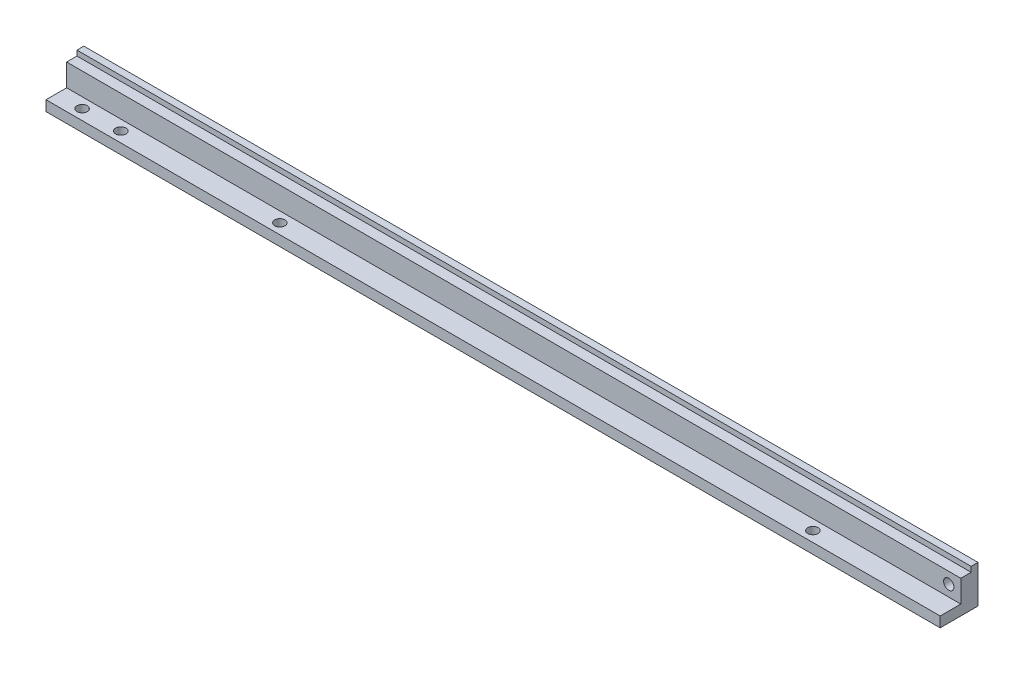
ISO-10303-21;
HEADER;
FILE_DESCRIPTION(('STEP AP214'),'2;1');
FILE_NAME('part.step','',(''),(''),'','','');
FILE_SCHEMA(('AUTOMOTIVE_DESIGN { 1 0 10303 214 1 1 1 1 }'));
ENDSEC;
DATA;
#1=APPLICATION_CONTEXT('core data for automotive mechanical design processes');
#2=APPLICATION_PROTOCOL_DEFINITION('international standard','automotive_design',2000,#1);
#3=PRODUCT_CONTEXT('',#1,'mechanical');
#4=PRODUCT('Part','Part','',(#3));
#5=PRODUCT_RELATED_PRODUCT_CATEGORY('part','',(#4));
#6=PRODUCT_DEFINITION_FORMATION('','',#4);
#7=PRODUCT_DEFINITION_CONTEXT('part definition',#1,'design');
#8=PRODUCT_DEFINITION('design','',#6,#7);
#9=PRODUCT_DEFINITION_SHAPE('','',#8);
#10=(LENGTH_UNIT() NAMED_UNIT(*) SI_UNIT(.MILLI.,.METRE.));
#11=(NAMED_UNIT(*) PLANE_ANGLE_UNIT() SI_UNIT($,.RADIAN.));
#12=(NAMED_UNIT(*) SI_UNIT($,.STERADIAN.) SOLID_ANGLE_UNIT());
#13=UNCERTAINTY_MEASURE_WITH_UNIT(LENGTH_MEASURE(1.E-05),#10,'distance_accuracy_value','');
#14=(GEOMETRIC_REPRESENTATION_CONTEXT(3) GLOBAL_UNCERTAINTY_ASSIGNED_CONTEXT((#13)) GLOBAL_UNIT_ASSIGNED_CONTEXT((#10,
#11,#12)) REPRESENTATION_CONTEXT('',''));
#15=CARTESIAN_POINT('',(0.,0.,0.));
#16=DIRECTION('',(0.,0.,1.));
#17=DIRECTION('',(1.,0.,0.));
#18=AXIS2_PLACEMENT_3D('',#15,#16,#17);
#19=CARTESIAN_POINT('',(260.,11.,0.));
#20=DIRECTION('',(0.,0.,1.));
#21=DIRECTION('',(0.,-1.,0.));
#22=AXIS2_PLACEMENT_3D('',#19,#20,#21);
#23=PLANE('',#22);
#24=CARTESIAN_POINT('',(256.5,6.25,0.));
#25=DIRECTION('',(0.,0.,1.));
#26=DIRECTION('',(1.,0.,0.));
#27=AXIS2_PLACEMENT_3D('',#24,#25,#26);
#28=CIRCLE('',#27,1.50000000000002);
#29=CARTESIAN_POINT('',(258.,6.25,0.));
#30=VERTEX_POINT('',#29);
#31=EDGE_CURVE('E134',#30,#30,#28,.T.);
#32=ORIENTED_EDGE('',*,*,#31,.T.);
#33=EDGE_LOOP('',(#32));
#34=FACE_BOUND('',#33,.T.);
#35=DIRECTION('',(0.,1.,0.));
#36=VECTOR('',#35,1.);
#37=CARTESIAN_POINT('',(0.,11.,0.));
#38=LINE('',#37,#36);
#39=CARTESIAN_POINT('',(0.,0.,0.));
#40=VERTEX_POINT('',#39);
#41=CARTESIAN_POINT('',(0.,11.,0.));
#42=VERTEX_POINT('',#41);
#43=EDGE_CURVE('E130',#40,#42,#38,.T.);
#44=ORIENTED_EDGE('',*,*,#43,.T.);
#45=DIRECTION('',(-1.,0.,0.));
#46=VECTOR('',#45,1.);
#47=CARTESIAN_POINT('',(260.,11.,0.));
#48=LINE('',#47,#46);
#49=CARTESIAN_POINT('',(260.,11.,0.));
#50=VERTEX_POINT('',#49);
#51=EDGE_CURVE('E11',#50,#42,#48,.T.);
#52=ORIENTED_EDGE('',*,*,#51,.F.);
#53=DIRECTION('',(0.,1.,0.));
#54=VECTOR('',#53,1.);
#55=CARTESIAN_POINT('',(260.,11.,0.));
#56=LINE('',#55,#54);
#57=CARTESIAN_POINT('',(260.,0.,0.));
#58=VERTEX_POINT('',#57);
#59=EDGE_CURVE('E145',#58,#50,#56,.T.);
#60=ORIENTED_EDGE('',*,*,#59,.F.);
#61=DIRECTION('',(-1.,0.,0.));
#62=VECTOR('',#61,1.);
#63=CARTESIAN_POINT('',(260.,0.,0.));
#64=LINE('',#63,#62);
#65=EDGE_CURVE('E126',#58,#40,#64,.T.);
#66=ORIENTED_EDGE('',*,*,#65,.T.);
#67=EDGE_LOOP('',(#44,#52,#60,#66));
#68=FACE_BOUND('',#67,.T.);
#69=ADVANCED_FACE('F34',(#34,#68),#23,.F.);
#70=CARTESIAN_POINT('',(260.,11.,2.));
#71=DIRECTION('',(0.,-1.,0.));
#72=DIRECTION('',(0.,0.,-1.));
#73=AXIS2_PLACEMENT_3D('',#70,#71,#72);
#74=PLANE('',#73);
#75=DIRECTION('',(0.,0.,1.));
#76=VECTOR('',#75,1.);
#77=CARTESIAN_POINT('',(0.,11.,2.));
#78=LINE('',#77,#76);
#79=CARTESIAN_POINT('',(0.,11.,2.));
#80=VERTEX_POINT('',#79);
#81=EDGE_CURVE('E133',#42,#80,#78,.T.);
#82=ORIENTED_EDGE('',*,*,#81,.T.);
#83=DIRECTION('',(-1.,0.,0.));
#84=VECTOR('',#83,1.);
#85=CARTESIAN_POINT('',(260.,11.,2.));
#86=LINE('',#85,#84);
#87=CARTESIAN_POINT('',(260.,11.,2.));
#88=VERTEX_POINT('',#87);
#89=EDGE_CURVE('E42',#88,#80,#86,.T.);
#90=ORIENTED_EDGE('',*,*,#89,.F.);
#91=DIRECTION('',(0.,0.,1.));
#92=VECTOR('',#91,1.);
#93=CARTESIAN_POINT('',(260.,11.,2.));
#94=LINE('',#93,#92);
#95=EDGE_CURVE('E93',#50,#88,#94,.T.);
#96=ORIENTED_EDGE('',*,*,#95,.F.);
#97=ORIENTED_EDGE('',*,*,#51,.T.);
#98=EDGE_LOOP('',(#82,#90,#96,#97));
#99=FACE_BOUND('',#98,.T.);
#100=ADVANCED_FACE('F243',(#99),#74,.F.);
#101=CARTESIAN_POINT('',(260.,9.5,2.));
#102=DIRECTION('',(0.,0.,-1.));
#103=DIRECTION('',(-1.,0.,0.));
#104=AXIS2_PLACEMENT_3D('',#101,#102,#103);
#105=PLANE('',#104);
#106=DIRECTION('',(0.,-1.,0.));
#107=VECTOR('',#106,1.);
#108=CARTESIAN_POINT('',(0.,9.5,2.));
#109=LINE('',#108,#107);
#110=CARTESIAN_POINT('',(0.,9.5,2.));
#111=VERTEX_POINT('',#110);
#112=EDGE_CURVE('E136',#80,#111,#109,.T.);
#113=ORIENTED_EDGE('',*,*,#112,.T.);
#114=DIRECTION('',(-1.,0.,0.));
#115=VECTOR('',#114,1.);
#116=CARTESIAN_POINT('',(260.,9.5,2.));
#117=LINE('',#116,#115);
#118=CARTESIAN_POINT('',(260.,9.5,2.));
#119=VERTEX_POINT('',#118);
#120=EDGE_CURVE('E152',#119,#111,#117,.T.);
#121=ORIENTED_EDGE('',*,*,#120,.F.);
#122=DIRECTION('',(0.,-1.,0.));
#123=VECTOR('',#122,1.);
#124=CARTESIAN_POINT('',(260.,9.5,2.));
#125=LINE('',#124,#123);
#126=EDGE_CURVE('E160',#88,#119,#125,.T.);
#127=ORIENTED_EDGE('',*,*,#126,.F.);
#128=ORIENTED_EDGE('',*,*,#89,.T.);
#129=EDGE_LOOP('',(#113,#121,#127,#128));
#130=FACE_BOUND('',#129,.T.);
#131=ADVANCED_FACE('F158',(#130),#105,.F.);
#132=CARTESIAN_POINT('',(260.,9.5,5.));
#133=DIRECTION('',(0.,-1.,0.));
#134=DIRECTION('',(0.,0.,-1.));
#135=AXIS2_PLACEMENT_3D('',#132,#133,#134);
#136=PLANE('',#135);
#137=DIRECTION('',(0.,0.,1.));
#138=VECTOR('',#137,1.);
#139=CARTESIAN_POINT('',(0.,9.5,5.));
#140=LINE('',#139,#138);
#141=CARTESIAN_POINT('',(0.,9.5,5.));
#142=VERTEX_POINT('',#141);
#143=EDGE_CURVE('E138',#111,#142,#140,.T.);
#144=ORIENTED_EDGE('',*,*,#143,.T.);
#145=DIRECTION('',(-1.,0.,0.));
#146=VECTOR('',#145,1.);
#147=CARTESIAN_POINT('',(260.,9.5,5.));
#148=LINE('',#147,#146);
#149=CARTESIAN_POINT('',(260.,9.5,5.));
#150=VERTEX_POINT('',#149);
#151=EDGE_CURVE('E149',#150,#142,#148,.T.);
#152=ORIENTED_EDGE('',*,*,#151,.F.);
#153=DIRECTION('',(0.,0.,1.));
#154=VECTOR('',#153,1.);
#155=CARTESIAN_POINT('',(260.,9.5,5.));
#156=LINE('',#155,#154);
#157=EDGE_CURVE('E172',#119,#150,#156,.T.);
#158=ORIENTED_EDGE('',*,*,#157,.F.);
#159=ORIENTED_EDGE('',*,*,#120,.T.);
#160=EDGE_LOOP('',(#144,#152,#158,#159));
#161=FACE_BOUND('',#160,.T.);
#162=ADVANCED_FACE('F168',(#161),#136,.F.);
#163=CARTESIAN_POINT('',(260.,3.,5.));
#164=DIRECTION('',(0.,0.,-1.));
#165=DIRECTION('',(-1.,0.,0.));
#166=AXIS2_PLACEMENT_3D('',#163,#164,#165);
#167=PLANE('',#166);
#168=CARTESIAN_POINT('',(256.5,6.25,5.));
#169=DIRECTION('',(0.,0.,1.));
#170=DIRECTION('',(1.,0.,0.));
#171=AXIS2_PLACEMENT_3D('',#168,#169,#170);
#172=CIRCLE('',#171,1.50000000000002);
#173=CARTESIAN_POINT('',(258.,6.25,5.));
#174=VERTEX_POINT('',#173);
#175=EDGE_CURVE('E178',#174,#174,#172,.T.);
#176=ORIENTED_EDGE('',*,*,#175,.F.);
#177=EDGE_LOOP('',(#176));
#178=FACE_BOUND('',#177,.T.);
#179=DIRECTION('',(0.,-1.,0.));
#180=VECTOR('',#179,1.);
#181=CARTESIAN_POINT('',(0.,3.,5.));
#182=LINE('',#181,#180);
#183=CARTESIAN_POINT('',(0.,3.,5.));
#184=VERTEX_POINT('',#183);
#185=EDGE_CURVE('E140',#142,#184,#182,.T.);
#186=ORIENTED_EDGE('',*,*,#185,.T.);
#187=DIRECTION('',(-1.,0.,0.));
#188=VECTOR('',#187,1.);
#189=CARTESIAN_POINT('',(260.,3.,5.));
#190=LINE('',#189,#188);
#191=CARTESIAN_POINT('',(260.,3.,5.));
#192=VERTEX_POINT('',#191);
#193=EDGE_CURVE('E121',#192,#184,#190,.T.);
#194=ORIENTED_EDGE('',*,*,#193,.F.);
#195=DIRECTION('',(0.,-1.,0.));
#196=VECTOR('',#195,1.);
#197=CARTESIAN_POINT('',(260.,3.,5.));
#198=LINE('',#197,#196);
#199=EDGE_CURVE('E112',#150,#192,#198,.T.);
#200=ORIENTED_EDGE('',*,*,#199,.F.);
#201=ORIENTED_EDGE('',*,*,#151,.T.);
#202=EDGE_LOOP('',(#186,#194,#200,#201));
#203=FACE_BOUND('',#202,.T.);
#204=ADVANCED_FACE('F171',(#178,#203),#167,.F.);
#205=CARTESIAN_POINT('',(260.,3.,11.));
#206=DIRECTION('',(0.,-1.,0.));
#207=DIRECTION('',(0.,0.,-1.));
#208=AXIS2_PLACEMENT_3D('',#205,#206,#207);
#209=PLANE('',#208);
#210=CARTESIAN_POINT('',(220.,3.,7.99999999999999));
#211=DIRECTION('',(0.,1.,0.));
#212=DIRECTION('',(0.,0.,1.));
#213=AXIS2_PLACEMENT_3D('',#210,#211,#212);
#214=CIRCLE('',#213,1.5);
#215=CARTESIAN_POINT('',(220.,3.,9.49999999999999));
#216=VERTEX_POINT('',#215);
#217=EDGE_CURVE('E202',#216,#216,#214,.T.);
#218=ORIENTED_EDGE('',*,*,#217,.F.);
#219=EDGE_LOOP('',(#218));
#220=FACE_BOUND('',#219,.T.);
#221=CARTESIAN_POINT('',(65.,3.,7.99999999999999));
#222=DIRECTION('',(0.,1.,0.));
#223=DIRECTION('',(0.,0.,1.));
#224=AXIS2_PLACEMENT_3D('',#221,#222,#223);
#225=CIRCLE('',#224,1.5);
#226=CARTESIAN_POINT('',(65.,3.,9.49999999999999));
#227=VERTEX_POINT('',#226);
#228=EDGE_CURVE('E196',#227,#227,#225,.T.);
#229=ORIENTED_EDGE('',*,*,#228,.F.);
#230=EDGE_LOOP('',(#229));
#231=FACE_BOUND('',#230,.T.);
#232=CARTESIAN_POINT('',(18.75,3.,8.));
#233=DIRECTION('',(0.,1.,0.));
#234=DIRECTION('',(0.,0.,1.));
#235=AXIS2_PLACEMENT_3D('',#232,#233,#234);
#236=CIRCLE('',#235,1.5);
#237=CARTESIAN_POINT('',(18.75,3.,9.5));
#238=VERTEX_POINT('',#237);
#239=EDGE_CURVE('E190',#238,#238,#236,.T.);
#240=ORIENTED_EDGE('',*,*,#239,.F.);
#241=EDGE_LOOP('',(#240));
#242=FACE_BOUND('',#241,.T.);
#243=CARTESIAN_POINT('',(7.5,3.,8.));
#244=DIRECTION('',(0.,1.,0.));
#245=DIRECTION('',(0.,0.,1.));
#246=AXIS2_PLACEMENT_3D('',#243,#244,#245);
#247=CIRCLE('',#246,1.5);
#248=CARTESIAN_POINT('',(7.5,3.,9.5));
#249=VERTEX_POINT('',#248);
#250=EDGE_CURVE('E184',#249,#249,#247,.T.);
#251=ORIENTED_EDGE('',*,*,#250,.F.);
#252=EDGE_LOOP('',(#251));
#253=FACE_BOUND('',#252,.T.);
#254=DIRECTION('',(0.,0.,1.));
#255=VECTOR('',#254,1.);
#256=CARTESIAN_POINT('',(0.,3.,11.));
#257=LINE('',#256,#255);
#258=CARTESIAN_POINT('',(0.,3.,11.));
#259=VERTEX_POINT('',#258);
#260=EDGE_CURVE('E120',#184,#259,#257,.T.);
#261=ORIENTED_EDGE('',*,*,#260,.T.);
#262=DIRECTION('',(-1.,0.,0.));
#263=VECTOR('',#262,1.);
#264=CARTESIAN_POINT('',(260.,3.,11.));
#265=LINE('',#264,#263);
#266=CARTESIAN_POINT('',(260.,3.,11.));
#267=VERTEX_POINT('',#266);
#268=EDGE_CURVE('E117',#267,#259,#265,.T.);
#269=ORIENTED_EDGE('',*,*,#268,.F.);
#270=DIRECTION('',(0.,0.,1.));
#271=VECTOR('',#270,1.);
#272=CARTESIAN_POINT('',(260.,3.,11.));
#273=LINE('',#272,#271);
#274=EDGE_CURVE('E106',#192,#267,#273,.T.);
#275=ORIENTED_EDGE('',*,*,#274,.F.);
#276=ORIENTED_EDGE('',*,*,#193,.T.);
#277=EDGE_LOOP('',(#261,#269,#275,#276));
#278=FACE_BOUND('',#277,.T.);
#279=ADVANCED_FACE('F118',(#220,#231,#242,#253,#278),#209,.F.);
#280=CARTESIAN_POINT('',(260.,0.,11.));
#281=DIRECTION('',(0.,0.,-1.));
#282=DIRECTION('',(-1.,0.,0.));
#283=AXIS2_PLACEMENT_3D('',#280,#281,#282);
#284=PLANE('',#283);
#285=DIRECTION('',(0.,-1.,0.));
#286=VECTOR('',#285,1.);
#287=CARTESIAN_POINT('',(0.,0.,11.));
#288=LINE('',#287,#286);
#289=CARTESIAN_POINT('',(0.,0.,11.));
#290=VERTEX_POINT('',#289);
#291=EDGE_CURVE('E79',#259,#290,#288,.T.);
#292=ORIENTED_EDGE('',*,*,#291,.T.);
#293=DIRECTION('',(-1.,0.,0.));
#294=VECTOR('',#293,1.);
#295=CARTESIAN_POINT('',(260.,0.,11.));
#296=LINE('',#295,#294);
#297=CARTESIAN_POINT('',(260.,0.,11.));
#298=VERTEX_POINT('',#297);
#299=EDGE_CURVE('E122',#298,#290,#296,.T.);
#300=ORIENTED_EDGE('',*,*,#299,.F.);
#301=DIRECTION('',(0.,-1.,0.));
#302=VECTOR('',#301,1.);
#303=CARTESIAN_POINT('',(260.,0.,11.));
#304=LINE('',#303,#302);
#305=EDGE_CURVE('E110',#267,#298,#304,.T.);
#306=ORIENTED_EDGE('',*,*,#305,.F.);
#307=ORIENTED_EDGE('',*,*,#268,.T.);
#308=EDGE_LOOP('',(#292,#300,#306,#307));
#309=FACE_BOUND('',#308,.T.);
#310=ADVANCED_FACE('F124',(#309),#284,.F.);
#311=CARTESIAN_POINT('',(260.,0.,0.));
#312=DIRECTION('',(0.,1.,0.));
#313=DIRECTION('',(0.,0.,1.));
#314=AXIS2_PLACEMENT_3D('',#311,#312,#313);
#315=PLANE('',#314);
#316=CARTESIAN_POINT('',(220.,0.,7.99999999999999));
#317=DIRECTION('',(0.,1.,0.));
#318=DIRECTION('',(0.,0.,1.));
#319=AXIS2_PLACEMENT_3D('',#316,#317,#318);
#320=CIRCLE('',#319,1.5);
#321=CARTESIAN_POINT('',(220.,0.,9.49999999999999));
#322=VERTEX_POINT('',#321);
#323=EDGE_CURVE('E199',#322,#322,#320,.T.);
#324=ORIENTED_EDGE('',*,*,#323,.T.);
#325=EDGE_LOOP('',(#324));
#326=FACE_BOUND('',#325,.T.);
#327=CARTESIAN_POINT('',(65.,0.,7.99999999999999));
#328=DIRECTION('',(0.,1.,0.));
#329=DIRECTION('',(0.,0.,1.));
#330=AXIS2_PLACEMENT_3D('',#327,#328,#329);
#331=CIRCLE('',#330,1.5);
#332=CARTESIAN_POINT('',(65.,0.,9.49999999999999));
#333=VERTEX_POINT('',#332);
#334=EDGE_CURVE('E193',#333,#333,#331,.T.);
#335=ORIENTED_EDGE('',*,*,#334,.T.);
#336=EDGE_LOOP('',(#335));
#337=FACE_BOUND('',#336,.T.);
#338=CARTESIAN_POINT('',(18.75,0.,8.));
#339=DIRECTION('',(0.,1.,0.));
#340=DIRECTION('',(0.,0.,1.));
#341=AXIS2_PLACEMENT_3D('',#338,#339,#340);
#342=CIRCLE('',#341,1.5);
#343=CARTESIAN_POINT('',(18.75,0.,9.5));
#344=VERTEX_POINT('',#343);
#345=EDGE_CURVE('E187',#344,#344,#342,.T.);
#346=ORIENTED_EDGE('',*,*,#345,.T.);
#347=EDGE_LOOP('',(#346));
#348=FACE_BOUND('',#347,.T.);
#349=CARTESIAN_POINT('',(7.5,0.,8.));
#350=DIRECTION('',(0.,1.,0.));
#351=DIRECTION('',(0.,0.,1.));
#352=AXIS2_PLACEMENT_3D('',#349,#350,#351);
#353=CIRCLE('',#352,1.5);
#354=CARTESIAN_POINT('',(7.5,0.,9.5));
#355=VERTEX_POINT('',#354);
#356=EDGE_CURVE('E181',#355,#355,#353,.T.);
#357=ORIENTED_EDGE('',*,*,#356,.T.);
#358=EDGE_LOOP('',(#357));
#359=FACE_BOUND('',#358,.T.);
#360=DIRECTION('',(0.,0.,-1.));
#361=VECTOR('',#360,1.);
#362=CARTESIAN_POINT('',(0.,0.,0.));
#363=LINE('',#362,#361);
#364=EDGE_CURVE('E85',#290,#40,#363,.T.);
#365=ORIENTED_EDGE('',*,*,#364,.T.);
#366=ORIENTED_EDGE('',*,*,#65,.F.);
#367=DIRECTION('',(0.,0.,-1.));
#368=VECTOR('',#367,1.);
#369=CARTESIAN_POINT('',(260.,0.,0.));
#370=LINE('',#369,#368);
#371=EDGE_CURVE('E50',#298,#58,#370,.T.);
#372=ORIENTED_EDGE('',*,*,#371,.F.);
#373=ORIENTED_EDGE('',*,*,#299,.T.);
#374=EDGE_LOOP('',(#365,#366,#372,#373));
#375=FACE_BOUND('',#374,.T.);
#376=ADVANCED_FACE('F208',(#326,#337,#348,#359,#375),#315,.F.);
#377=CARTESIAN_POINT('',(260.,0.,0.));
#378=DIRECTION('',(-1.,0.,0.));
#379=DIRECTION('',(0.,0.,1.));
#380=AXIS2_PLACEMENT_3D('',#377,#378,#379);
#381=PLANE('',#380);
#382=ORIENTED_EDGE('',*,*,#59,.T.);
#383=ORIENTED_EDGE('',*,*,#95,.T.);
#384=ORIENTED_EDGE('',*,*,#126,.T.);
#385=ORIENTED_EDGE('',*,*,#157,.T.);
#386=ORIENTED_EDGE('',*,*,#199,.T.);
#387=ORIENTED_EDGE('',*,*,#274,.T.);
#388=ORIENTED_EDGE('',*,*,#305,.T.);
#389=ORIENTED_EDGE('',*,*,#371,.T.);
#390=EDGE_LOOP('',(#382,#383,#384,#385,#386,#387,#388,#389));
#391=FACE_BOUND('',#390,.T.);
#392=ADVANCED_FACE('F108',(#391),#381,.F.);
#393=CARTESIAN_POINT('',(0.,0.,0.));
#394=DIRECTION('',(-1.,0.,0.));
#395=DIRECTION('',(0.,0.,1.));
#396=AXIS2_PLACEMENT_3D('',#393,#394,#395);
#397=PLANE('',#396);
#398=ORIENTED_EDGE('',*,*,#43,.F.);
#399=ORIENTED_EDGE('',*,*,#364,.F.);
#400=ORIENTED_EDGE('',*,*,#291,.F.);
#401=ORIENTED_EDGE('',*,*,#260,.F.);
#402=ORIENTED_EDGE('',*,*,#185,.F.);
#403=ORIENTED_EDGE('',*,*,#143,.F.);
#404=ORIENTED_EDGE('',*,*,#112,.F.);
#405=ORIENTED_EDGE('',*,*,#81,.F.);
#406=EDGE_LOOP('',(#398,#399,#400,#401,#402,#403,#404,#405));
#407=FACE_BOUND('',#406,.T.);
#408=ADVANCED_FACE('F164',(#407),#397,.T.);
#409=CARTESIAN_POINT('',(256.5,6.25,0.));
#410=DIRECTION('',(0.,0.,1.));
#411=DIRECTION('',(1.,0.,0.));
#412=AXIS2_PLACEMENT_3D('',#409,#410,#411);
#413=CYLINDRICAL_SURFACE('',#412,1.50000000000002);
#414=ORIENTED_EDGE('',*,*,#31,.F.);
#415=EDGE_LOOP('',(#414));
#416=FACE_BOUND('',#415,.T.);
#417=ORIENTED_EDGE('',*,*,#175,.T.);
#418=EDGE_LOOP('',(#417));
#419=FACE_BOUND('',#418,.T.);
#420=ADVANCED_FACE('F230',(#416,#419),#413,.F.);
#421=CARTESIAN_POINT('',(7.5,0.,8.));
#422=DIRECTION('',(0.,1.,0.));
#423=DIRECTION('',(0.,0.,1.));
#424=AXIS2_PLACEMENT_3D('',#421,#422,#423);
#425=CYLINDRICAL_SURFACE('',#424,1.5);
#426=ORIENTED_EDGE('',*,*,#356,.F.);
#427=EDGE_LOOP('',(#426));
#428=FACE_BOUND('',#427,.T.);
#429=ORIENTED_EDGE('',*,*,#250,.T.);
#430=EDGE_LOOP('',(#429));
#431=FACE_BOUND('',#430,.T.);
#432=ADVANCED_FACE('F227',(#428,#431),#425,.F.);
#433=CARTESIAN_POINT('',(18.75,0.,8.));
#434=DIRECTION('',(0.,1.,0.));
#435=DIRECTION('',(0.,0.,1.));
#436=AXIS2_PLACEMENT_3D('',#433,#434,#435);
#437=CYLINDRICAL_SURFACE('',#436,1.5);
#438=ORIENTED_EDGE('',*,*,#345,.F.);
#439=EDGE_LOOP('',(#438));
#440=FACE_BOUND('',#439,.T.);
#441=ORIENTED_EDGE('',*,*,#239,.T.);
#442=EDGE_LOOP('',(#441));
#443=FACE_BOUND('',#442,.T.);
#444=ADVANCED_FACE('F229',(#440,#443),#437,.F.);
#445=CARTESIAN_POINT('',(65.,0.,7.99999999999999));
#446=DIRECTION('',(0.,1.,0.));
#447=DIRECTION('',(0.,0.,1.));
#448=AXIS2_PLACEMENT_3D('',#445,#446,#447);
#449=CYLINDRICAL_SURFACE('',#448,1.5);
#450=ORIENTED_EDGE('',*,*,#334,.F.);
#451=EDGE_LOOP('',(#450));
#452=FACE_BOUND('',#451,.T.);
#453=ORIENTED_EDGE('',*,*,#228,.T.);
#454=EDGE_LOOP('',(#453));
#455=FACE_BOUND('',#454,.T.);
#456=ADVANCED_FACE('F214',(#452,#455),#449,.F.);
#457=CARTESIAN_POINT('',(220.,0.,7.99999999999999));
#458=DIRECTION('',(0.,1.,0.));
#459=DIRECTION('',(0.,0.,1.));
#460=AXIS2_PLACEMENT_3D('',#457,#458,#459);
#461=CYLINDRICAL_SURFACE('',#460,1.5);
#462=ORIENTED_EDGE('',*,*,#323,.F.);
#463=EDGE_LOOP('',(#462));
#464=FACE_BOUND('',#463,.T.);
#465=ORIENTED_EDGE('',*,*,#217,.T.);
#466=EDGE_LOOP('',(#465));
#467=FACE_BOUND('',#466,.T.);
#468=ADVANCED_FACE('F211',(#464,#467),#461,.F.);
#469=CLOSED_SHELL('',(#69,#100,#131,#162,#204,#279,#310,#376,#392,#408,#420,#432,#444,#456,#468));
#470=MANIFOLD_SOLID_BREP('B2',#469);
#471=ADVANCED_BREP_SHAPE_REPRESENTATION('',(#18,#470),#14);
#472=SHAPE_DEFINITION_REPRESENTATION(#9,#471);
ENDSEC;
END-ISO-10303-21;
